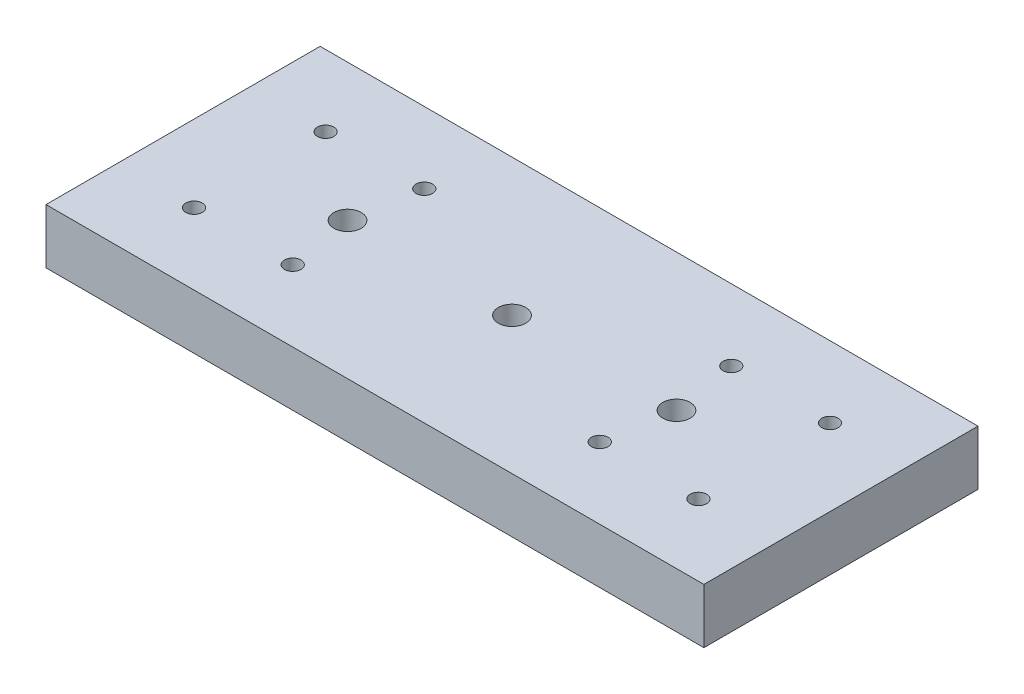
ISO-10303-21;
HEADER;
FILE_DESCRIPTION(('STEP AP214'),'2;1');
FILE_NAME('part.step','',(''),(''),'','','');
FILE_SCHEMA(('AUTOMOTIVE_DESIGN { 1 0 10303 214 1 1 1 1 }'));
ENDSEC;
DATA;
#1=APPLICATION_CONTEXT('core data for automotive mechanical design processes');
#2=APPLICATION_PROTOCOL_DEFINITION('international standard','automotive_design',2000,#1);
#3=PRODUCT_CONTEXT('',#1,'mechanical');
#4=PRODUCT('Part','Part','',(#3));
#5=PRODUCT_RELATED_PRODUCT_CATEGORY('part','',(#4));
#6=PRODUCT_DEFINITION_FORMATION('','',#4);
#7=PRODUCT_DEFINITION_CONTEXT('part definition',#1,'design');
#8=PRODUCT_DEFINITION('design','',#6,#7);
#9=PRODUCT_DEFINITION_SHAPE('','',#8);
#10=(LENGTH_UNIT() NAMED_UNIT(*) SI_UNIT(.MILLI.,.METRE.));
#11=(NAMED_UNIT(*) PLANE_ANGLE_UNIT() SI_UNIT($,.RADIAN.));
#12=(NAMED_UNIT(*) SI_UNIT($,.STERADIAN.) SOLID_ANGLE_UNIT());
#13=UNCERTAINTY_MEASURE_WITH_UNIT(LENGTH_MEASURE(1.E-05),#10,'distance_accuracy_value','');
#14=(GEOMETRIC_REPRESENTATION_CONTEXT(3) GLOBAL_UNCERTAINTY_ASSIGNED_CONTEXT((#13)) GLOBAL_UNIT_ASSIGNED_CONTEXT((#10,
#11,#12)) REPRESENTATION_CONTEXT('',''));
#15=CARTESIAN_POINT('',(0.,0.,0.));
#16=DIRECTION('',(0.,0.,1.));
#17=DIRECTION('',(1.,0.,0.));
#18=AXIS2_PLACEMENT_3D('',#15,#16,#17);
#19=CARTESIAN_POINT('',(0.,10.,0.));
#20=DIRECTION('',(0.,-1.,0.));
#21=DIRECTION('',(0.,0.,-1.));
#22=AXIS2_PLACEMENT_3D('',#19,#20,#21);
#23=CYLINDRICAL_SURFACE('',#22,2.5);
#24=CARTESIAN_POINT('',(0.,10.,0.));
#25=DIRECTION('',(0.,-1.,0.));
#26=DIRECTION('',(0.,0.,-1.));
#27=AXIS2_PLACEMENT_3D('',#24,#25,#26);
#28=CIRCLE('',#27,2.5);
#29=CARTESIAN_POINT('',(0.,10.,-2.5));
#30=VERTEX_POINT('',#29);
#31=EDGE_CURVE('E128',#30,#30,#28,.T.);
#32=ORIENTED_EDGE('',*,*,#31,.F.);
#33=EDGE_LOOP('',(#32));
#34=FACE_BOUND('',#33,.T.);
#35=CARTESIAN_POINT('',(0.,5.,0.));
#36=DIRECTION('',(0.,-1.,0.));
#37=DIRECTION('',(0.,0.,-1.));
#38=AXIS2_PLACEMENT_3D('',#35,#36,#37);
#39=CIRCLE('',#38,2.5);
#40=CARTESIAN_POINT('',(0.,5.,-2.5));
#41=VERTEX_POINT('',#40);
#42=EDGE_CURVE('E39',#41,#41,#39,.F.);
#43=ORIENTED_EDGE('',*,*,#42,.F.);
#44=EDGE_LOOP('',(#43));
#45=FACE_BOUND('',#44,.T.);
#46=ADVANCED_FACE('F35',(#34,#45),#23,.F.);
#47=CARTESIAN_POINT('',(29.9999999999984,10.,0.));
#48=DIRECTION('',(0.,-1.,0.));
#49=DIRECTION('',(0.,0.,-1.));
#50=AXIS2_PLACEMENT_3D('',#47,#48,#49);
#51=CYLINDRICAL_SURFACE('',#50,2.5);
#52=CARTESIAN_POINT('',(29.9999999999984,10.,0.));
#53=DIRECTION('',(0.,-1.,0.));
#54=DIRECTION('',(0.,0.,-1.));
#55=AXIS2_PLACEMENT_3D('',#52,#53,#54);
#56=CIRCLE('',#55,2.5);
#57=CARTESIAN_POINT('',(29.9999999999984,10.,-2.5));
#58=VERTEX_POINT('',#57);
#59=EDGE_CURVE('E123',#58,#58,#56,.T.);
#60=ORIENTED_EDGE('',*,*,#59,.F.);
#61=EDGE_LOOP('',(#60));
#62=FACE_BOUND('',#61,.T.);
#63=CARTESIAN_POINT('',(29.9999999999984,5.,0.));
#64=DIRECTION('',(0.,-1.,0.));
#65=DIRECTION('',(0.,0.,-1.));
#66=AXIS2_PLACEMENT_3D('',#63,#64,#65);
#67=CIRCLE('',#66,2.5);
#68=CARTESIAN_POINT('',(29.9999999999984,5.,-2.5));
#69=VERTEX_POINT('',#68);
#70=EDGE_CURVE('E113',#69,#69,#67,.F.);
#71=ORIENTED_EDGE('',*,*,#70,.F.);
#72=EDGE_LOOP('',(#71));
#73=FACE_BOUND('',#72,.T.);
#74=ADVANCED_FACE('F200',(#62,#73),#51,.F.);
#75=CARTESIAN_POINT('',(-30.,10.,0.));
#76=DIRECTION('',(0.,-1.,0.));
#77=DIRECTION('',(0.,0.,-1.));
#78=AXIS2_PLACEMENT_3D('',#75,#76,#77);
#79=CYLINDRICAL_SURFACE('',#78,2.5);
#80=CARTESIAN_POINT('',(-30.,10.,0.));
#81=DIRECTION('',(0.,-1.,0.));
#82=DIRECTION('',(0.,0.,-1.));
#83=AXIS2_PLACEMENT_3D('',#80,#81,#82);
#84=CIRCLE('',#83,2.5);
#85=CARTESIAN_POINT('',(-30.,10.,-2.5));
#86=VERTEX_POINT('',#85);
#87=EDGE_CURVE('E119',#86,#86,#84,.T.);
#88=ORIENTED_EDGE('',*,*,#87,.F.);
#89=EDGE_LOOP('',(#88));
#90=FACE_BOUND('',#89,.T.);
#91=CARTESIAN_POINT('',(-30.,5.,0.));
#92=DIRECTION('',(0.,-1.,0.));
#93=DIRECTION('',(0.,0.,-1.));
#94=AXIS2_PLACEMENT_3D('',#91,#92,#93);
#95=CIRCLE('',#94,2.5);
#96=CARTESIAN_POINT('',(-30.,5.,-2.5));
#97=VERTEX_POINT('',#96);
#98=EDGE_CURVE('E111',#97,#97,#95,.F.);
#99=ORIENTED_EDGE('',*,*,#98,.F.);
#100=EDGE_LOOP('',(#99));
#101=FACE_BOUND('',#100,.T.);
#102=ADVANCED_FACE('F206',(#90,#101),#79,.F.);
#103=CARTESIAN_POINT('',(-60.,10.,25.));
#104=DIRECTION('',(1.,0.,0.));
#105=DIRECTION('',(0.,0.,-1.));
#106=AXIS2_PLACEMENT_3D('',#103,#104,#105);
#107=PLANE('',#106);
#108=DIRECTION('',(0.,0.,1.));
#109=VECTOR('',#108,1.);
#110=CARTESIAN_POINT('',(-60.,0.,25.));
#111=LINE('',#110,#109);
#112=CARTESIAN_POINT('',(-60.,0.,-25.));
#113=VERTEX_POINT('',#112);
#114=CARTESIAN_POINT('',(-60.,0.,25.));
#115=VERTEX_POINT('',#114);
#116=EDGE_CURVE('E102',#113,#115,#111,.T.);
#117=ORIENTED_EDGE('',*,*,#116,.T.);
#118=DIRECTION('',(0.,-1.,0.));
#119=VECTOR('',#118,1.);
#120=CARTESIAN_POINT('',(-60.,10.,25.));
#121=LINE('',#120,#119);
#122=CARTESIAN_POINT('',(-60.,10.,25.));
#123=VERTEX_POINT('',#122);
#124=EDGE_CURVE('E11',#123,#115,#121,.T.);
#125=ORIENTED_EDGE('',*,*,#124,.F.);
#126=DIRECTION('',(0.,0.,1.));
#127=VECTOR('',#126,1.);
#128=CARTESIAN_POINT('',(-60.,10.,25.));
#129=LINE('',#128,#127);
#130=CARTESIAN_POINT('',(-60.,10.,-25.));
#131=VERTEX_POINT('',#130);
#132=EDGE_CURVE('E89',#131,#123,#129,.T.);
#133=ORIENTED_EDGE('',*,*,#132,.F.);
#134=DIRECTION('',(0.,-1.,0.));
#135=VECTOR('',#134,1.);
#136=CARTESIAN_POINT('',(-60.,10.,-25.));
#137=LINE('',#136,#135);
#138=EDGE_CURVE('E98',#131,#113,#137,.T.);
#139=ORIENTED_EDGE('',*,*,#138,.T.);
#140=EDGE_LOOP('',(#117,#125,#133,#139));
#141=FACE_BOUND('',#140,.T.);
#142=ADVANCED_FACE('F37',(#141),#107,.F.);
#143=CARTESIAN_POINT('',(60.,10.,25.));
#144=DIRECTION('',(0.,0.,-1.));
#145=DIRECTION('',(-1.,0.,0.));
#146=AXIS2_PLACEMENT_3D('',#143,#144,#145);
#147=PLANE('',#146);
#148=DIRECTION('',(1.,0.,0.));
#149=VECTOR('',#148,1.);
#150=CARTESIAN_POINT('',(60.,0.,25.));
#151=LINE('',#150,#149);
#152=CARTESIAN_POINT('',(60.,0.,25.));
#153=VERTEX_POINT('',#152);
#154=EDGE_CURVE('E93',#115,#153,#151,.T.);
#155=ORIENTED_EDGE('',*,*,#154,.T.);
#156=DIRECTION('',(0.,-1.,0.));
#157=VECTOR('',#156,1.);
#158=CARTESIAN_POINT('',(60.,10.,25.));
#159=LINE('',#158,#157);
#160=CARTESIAN_POINT('',(60.,10.,25.));
#161=VERTEX_POINT('',#160);
#162=EDGE_CURVE('E45',#161,#153,#159,.T.);
#163=ORIENTED_EDGE('',*,*,#162,.F.);
#164=DIRECTION('',(1.,0.,0.));
#165=VECTOR('',#164,1.);
#166=CARTESIAN_POINT('',(60.,10.,25.));
#167=LINE('',#166,#165);
#168=EDGE_CURVE('E84',#123,#161,#167,.T.);
#169=ORIENTED_EDGE('',*,*,#168,.F.);
#170=ORIENTED_EDGE('',*,*,#124,.T.);
#171=EDGE_LOOP('',(#155,#163,#169,#170));
#172=FACE_BOUND('',#171,.T.);
#173=ADVANCED_FACE('F92',(#172),#147,.F.);
#174=CARTESIAN_POINT('',(60.,10.,25.));
#175=DIRECTION('',(-1.,0.,0.));
#176=DIRECTION('',(0.,0.,1.));
#177=AXIS2_PLACEMENT_3D('',#174,#175,#176);
#178=PLANE('',#177);
#179=DIRECTION('',(0.,0.,-1.));
#180=VECTOR('',#179,1.);
#181=CARTESIAN_POINT('',(60.,0.,25.));
#182=LINE('',#181,#180);
#183=CARTESIAN_POINT('',(60.,0.,-25.));
#184=VERTEX_POINT('',#183);
#185=EDGE_CURVE('E71',#153,#184,#182,.T.);
#186=ORIENTED_EDGE('',*,*,#185,.T.);
#187=DIRECTION('',(0.,-1.,0.));
#188=VECTOR('',#187,1.);
#189=CARTESIAN_POINT('',(60.,10.,-25.));
#190=LINE('',#189,#188);
#191=CARTESIAN_POINT('',(60.,10.,-25.));
#192=VERTEX_POINT('',#191);
#193=EDGE_CURVE('E94',#192,#184,#190,.T.);
#194=ORIENTED_EDGE('',*,*,#193,.F.);
#195=DIRECTION('',(0.,0.,-1.));
#196=VECTOR('',#195,1.);
#197=CARTESIAN_POINT('',(60.,10.,25.));
#198=LINE('',#197,#196);
#199=EDGE_CURVE('E87',#161,#192,#198,.T.);
#200=ORIENTED_EDGE('',*,*,#199,.F.);
#201=ORIENTED_EDGE('',*,*,#162,.T.);
#202=EDGE_LOOP('',(#186,#194,#200,#201));
#203=FACE_BOUND('',#202,.T.);
#204=ADVANCED_FACE('F96',(#203),#178,.F.);
#205=CARTESIAN_POINT('',(60.,10.,-25.));
#206=DIRECTION('',(0.,0.,1.));
#207=DIRECTION('',(1.,0.,0.));
#208=AXIS2_PLACEMENT_3D('',#205,#206,#207);
#209=PLANE('',#208);
#210=DIRECTION('',(-1.,0.,0.));
#211=VECTOR('',#210,1.);
#212=CARTESIAN_POINT('',(60.,0.,-25.));
#213=LINE('',#212,#211);
#214=EDGE_CURVE('E77',#184,#113,#213,.T.);
#215=ORIENTED_EDGE('',*,*,#214,.T.);
#216=ORIENTED_EDGE('',*,*,#138,.F.);
#217=DIRECTION('',(-1.,0.,0.));
#218=VECTOR('',#217,1.);
#219=CARTESIAN_POINT('',(60.,10.,-25.));
#220=LINE('',#219,#218);
#221=EDGE_CURVE('E54',#192,#131,#220,.T.);
#222=ORIENTED_EDGE('',*,*,#221,.F.);
#223=ORIENTED_EDGE('',*,*,#193,.T.);
#224=EDGE_LOOP('',(#215,#216,#222,#223));
#225=FACE_BOUND('',#224,.T.);
#226=ADVANCED_FACE('F186',(#225),#209,.F.);
#227=CARTESIAN_POINT('',(0.,10.,0.));
#228=DIRECTION('',(0.,1.,0.));
#229=DIRECTION('',(0.,0.,1.));
#230=AXIS2_PLACEMENT_3D('',#227,#228,#229);
#231=PLANE('',#230);
#232=ORIENTED_EDGE('',*,*,#87,.T.);
#233=EDGE_LOOP('',(#232));
#234=FACE_BOUND('',#233,.T.);
#235=ORIENTED_EDGE('',*,*,#59,.T.);
#236=EDGE_LOOP('',(#235));
#237=FACE_BOUND('',#236,.T.);
#238=ORIENTED_EDGE('',*,*,#31,.T.);
#239=EDGE_LOOP('',(#238));
#240=FACE_BOUND('',#239,.T.);
#241=CARTESIAN_POINT('',(-45.9999999999993,10.,12.0000000000002));
#242=DIRECTION('',(0.,1.,0.));
#243=DIRECTION('',(0.,0.,1.));
#244=AXIS2_PLACEMENT_3D('',#241,#242,#243);
#245=CIRCLE('',#244,1.5);
#246=CARTESIAN_POINT('',(-45.9999999999993,10.,13.5000000000002));
#247=VERTEX_POINT('',#246);
#248=EDGE_CURVE('E144',#247,#247,#245,.T.);
#249=ORIENTED_EDGE('',*,*,#248,.F.);
#250=EDGE_LOOP('',(#249));
#251=FACE_BOUND('',#250,.T.);
#252=CARTESIAN_POINT('',(46.0000000000006,10.,-12.0000000000001));
#253=DIRECTION('',(0.,1.,0.));
#254=DIRECTION('',(0.,0.,1.));
#255=AXIS2_PLACEMENT_3D('',#252,#253,#254);
#256=CIRCLE('',#255,1.5);
#257=CARTESIAN_POINT('',(46.0000000000006,10.,-10.5000000000001));
#258=VERTEX_POINT('',#257);
#259=EDGE_CURVE('E157',#258,#258,#256,.T.);
#260=ORIENTED_EDGE('',*,*,#259,.F.);
#261=EDGE_LOOP('',(#260));
#262=FACE_BOUND('',#261,.T.);
#263=CARTESIAN_POINT('',(46.0000000000007,10.,11.9999999999999));
#264=DIRECTION('',(0.,1.,0.));
#265=DIRECTION('',(0.,0.,1.));
#266=AXIS2_PLACEMENT_3D('',#263,#264,#265);
#267=CIRCLE('',#266,1.5);
#268=CARTESIAN_POINT('',(46.0000000000007,10.,13.4999999999999));
#269=VERTEX_POINT('',#268);
#270=EDGE_CURVE('E156',#269,#269,#267,.T.);
#271=ORIENTED_EDGE('',*,*,#270,.F.);
#272=EDGE_LOOP('',(#271));
#273=FACE_BOUND('',#272,.T.);
#274=CARTESIAN_POINT('',(28.0000000000006,10.,-12.));
#275=DIRECTION('',(0.,1.,0.));
#276=DIRECTION('',(0.,0.,1.));
#277=AXIS2_PLACEMENT_3D('',#274,#275,#276);
#278=CIRCLE('',#277,1.5);
#279=CARTESIAN_POINT('',(28.0000000000006,10.,-10.5));
#280=VERTEX_POINT('',#279);
#281=EDGE_CURVE('E169',#280,#280,#278,.T.);
#282=ORIENTED_EDGE('',*,*,#281,.F.);
#283=EDGE_LOOP('',(#282));
#284=FACE_BOUND('',#283,.T.);
#285=CARTESIAN_POINT('',(-27.9999999999994,10.,-11.9999999999998));
#286=DIRECTION('',(0.,1.,0.));
#287=DIRECTION('',(0.,0.,1.));
#288=AXIS2_PLACEMENT_3D('',#285,#286,#287);
#289=CIRCLE('',#288,1.5);
#290=CARTESIAN_POINT('',(-27.9999999999994,10.,-10.4999999999998));
#291=VERTEX_POINT('',#290);
#292=EDGE_CURVE('E134',#291,#291,#289,.T.);
#293=ORIENTED_EDGE('',*,*,#292,.F.);
#294=EDGE_LOOP('',(#293));
#295=FACE_BOUND('',#294,.T.);
#296=CARTESIAN_POINT('',(-27.9999999999993,10.,12.0000000000002));
#297=DIRECTION('',(0.,1.,0.));
#298=DIRECTION('',(0.,0.,1.));
#299=AXIS2_PLACEMENT_3D('',#296,#297,#298);
#300=CIRCLE('',#299,1.5);
#301=CARTESIAN_POINT('',(-27.9999999999993,10.,13.5000000000002));
#302=VERTEX_POINT('',#301);
#303=EDGE_CURVE('E138',#302,#302,#300,.T.);
#304=ORIENTED_EDGE('',*,*,#303,.F.);
#305=EDGE_LOOP('',(#304));
#306=FACE_BOUND('',#305,.T.);
#307=CARTESIAN_POINT('',(-45.9999999999994,10.,-11.9999999999998));
#308=DIRECTION('',(0.,1.,0.));
#309=DIRECTION('',(0.,0.,1.));
#310=AXIS2_PLACEMENT_3D('',#307,#308,#309);
#311=CIRCLE('',#310,1.5);
#312=CARTESIAN_POINT('',(-45.9999999999994,10.,-10.4999999999998));
#313=VERTEX_POINT('',#312);
#314=EDGE_CURVE('E145',#313,#313,#311,.T.);
#315=ORIENTED_EDGE('',*,*,#314,.F.);
#316=EDGE_LOOP('',(#315));
#317=FACE_BOUND('',#316,.T.);
#318=CARTESIAN_POINT('',(28.0000000000007,10.,12.));
#319=DIRECTION('',(0.,1.,0.));
#320=DIRECTION('',(0.,0.,1.));
#321=AXIS2_PLACEMENT_3D('',#318,#319,#320);
#322=CIRCLE('',#321,1.5);
#323=CARTESIAN_POINT('',(28.0000000000007,10.,13.5));
#324=VERTEX_POINT('',#323);
#325=EDGE_CURVE('E168',#324,#324,#322,.T.);
#326=ORIENTED_EDGE('',*,*,#325,.F.);
#327=EDGE_LOOP('',(#326));
#328=FACE_BOUND('',#327,.T.);
#329=ORIENTED_EDGE('',*,*,#132,.T.);
#330=ORIENTED_EDGE('',*,*,#168,.T.);
#331=ORIENTED_EDGE('',*,*,#199,.T.);
#332=ORIENTED_EDGE('',*,*,#221,.T.);
#333=EDGE_LOOP('',(#329,#330,#331,#332));
#334=FACE_BOUND('',#333,.T.);
#335=ADVANCED_FACE('F85',(#234,#237,#240,#251,#262,#273,#284,#295,#306,#317,#328,#334),#231,.T.);
#336=CARTESIAN_POINT('',(0.,0.,0.));
#337=DIRECTION('',(0.,1.,0.));
#338=DIRECTION('',(0.,0.,1.));
#339=AXIS2_PLACEMENT_3D('',#336,#337,#338);
#340=PLANE('',#339);
#341=CARTESIAN_POINT('',(29.9999999999984,0.,0.));
#342=DIRECTION('',(0.,-1.,0.));
#343=DIRECTION('',(0.,0.,-1.));
#344=AXIS2_PLACEMENT_3D('',#341,#342,#343);
#345=CIRCLE('',#344,4.25);
#346=CARTESIAN_POINT('',(29.9999999999984,0.,-4.25));
#347=VERTEX_POINT('',#346);
#348=EDGE_CURVE('E291',#347,#347,#345,.T.);
#349=ORIENTED_EDGE('',*,*,#348,.F.);
#350=EDGE_LOOP('',(#349));
#351=FACE_BOUND('',#350,.T.);
#352=CARTESIAN_POINT('',(0.,0.,0.));
#353=DIRECTION('',(0.,-1.,0.));
#354=DIRECTION('',(0.,0.,-1.));
#355=AXIS2_PLACEMENT_3D('',#352,#353,#354);
#356=CIRCLE('',#355,4.25);
#357=CARTESIAN_POINT('',(0.,0.,-4.25));
#358=VERTEX_POINT('',#357);
#359=EDGE_CURVE('E299',#358,#358,#356,.T.);
#360=ORIENTED_EDGE('',*,*,#359,.F.);
#361=EDGE_LOOP('',(#360));
#362=FACE_BOUND('',#361,.T.);
#363=CARTESIAN_POINT('',(-30.,0.,0.));
#364=DIRECTION('',(0.,-1.,0.));
#365=DIRECTION('',(0.,0.,-1.));
#366=AXIS2_PLACEMENT_3D('',#363,#364,#365);
#367=CIRCLE('',#366,4.25);
#368=CARTESIAN_POINT('',(-30.,0.,-4.25));
#369=VERTEX_POINT('',#368);
#370=EDGE_CURVE('E303',#369,#369,#367,.T.);
#371=ORIENTED_EDGE('',*,*,#370,.F.);
#372=EDGE_LOOP('',(#371));
#373=FACE_BOUND('',#372,.T.);
#374=CARTESIAN_POINT('',(-45.9999999999993,0.,12.0000000000002));
#375=DIRECTION('',(0.,1.,0.));
#376=DIRECTION('',(0.,0.,1.));
#377=AXIS2_PLACEMENT_3D('',#374,#375,#376);
#378=CIRCLE('',#377,1.5);
#379=CARTESIAN_POINT('',(-45.9999999999993,0.,13.5000000000002));
#380=VERTEX_POINT('',#379);
#381=EDGE_CURVE('E160',#380,#380,#378,.T.);
#382=ORIENTED_EDGE('',*,*,#381,.T.);
#383=EDGE_LOOP('',(#382));
#384=FACE_BOUND('',#383,.T.);
#385=CARTESIAN_POINT('',(46.0000000000006,0.,-12.0000000000001));
#386=DIRECTION('',(0.,1.,0.));
#387=DIRECTION('',(0.,0.,1.));
#388=AXIS2_PLACEMENT_3D('',#385,#386,#387);
#389=CIRCLE('',#388,1.5);
#390=CARTESIAN_POINT('',(46.0000000000006,0.,-10.5000000000001));
#391=VERTEX_POINT('',#390);
#392=EDGE_CURVE('E153',#391,#391,#389,.T.);
#393=ORIENTED_EDGE('',*,*,#392,.T.);
#394=EDGE_LOOP('',(#393));
#395=FACE_BOUND('',#394,.T.);
#396=CARTESIAN_POINT('',(46.0000000000007,0.,11.9999999999999));
#397=DIRECTION('',(0.,1.,0.));
#398=DIRECTION('',(0.,0.,1.));
#399=AXIS2_PLACEMENT_3D('',#396,#397,#398);
#400=CIRCLE('',#399,1.5);
#401=CARTESIAN_POINT('',(46.0000000000007,0.,13.4999999999999));
#402=VERTEX_POINT('',#401);
#403=EDGE_CURVE('E172',#402,#402,#400,.T.);
#404=ORIENTED_EDGE('',*,*,#403,.T.);
#405=EDGE_LOOP('',(#404));
#406=FACE_BOUND('',#405,.T.);
#407=CARTESIAN_POINT('',(28.0000000000006,0.,-12.));
#408=DIRECTION('',(0.,1.,0.));
#409=DIRECTION('',(0.,0.,1.));
#410=AXIS2_PLACEMENT_3D('',#407,#408,#409);
#411=CIRCLE('',#410,1.5);
#412=CARTESIAN_POINT('',(28.0000000000006,0.,-10.5));
#413=VERTEX_POINT('',#412);
#414=EDGE_CURVE('E165',#413,#413,#411,.T.);
#415=ORIENTED_EDGE('',*,*,#414,.T.);
#416=EDGE_LOOP('',(#415));
#417=FACE_BOUND('',#416,.T.);
#418=CARTESIAN_POINT('',(-27.9999999999994,0.,-11.9999999999998));
#419=DIRECTION('',(0.,1.,0.));
#420=DIRECTION('',(0.,0.,1.));
#421=AXIS2_PLACEMENT_3D('',#418,#419,#420);
#422=CIRCLE('',#421,1.5);
#423=CARTESIAN_POINT('',(-27.9999999999994,0.,-10.4999999999998));
#424=VERTEX_POINT('',#423);
#425=EDGE_CURVE('E135',#424,#424,#422,.T.);
#426=ORIENTED_EDGE('',*,*,#425,.T.);
#427=EDGE_LOOP('',(#426));
#428=FACE_BOUND('',#427,.T.);
#429=CARTESIAN_POINT('',(-27.9999999999993,0.,12.0000000000002));
#430=DIRECTION('',(0.,1.,0.));
#431=DIRECTION('',(0.,0.,1.));
#432=AXIS2_PLACEMENT_3D('',#429,#430,#431);
#433=CIRCLE('',#432,1.5);
#434=CARTESIAN_POINT('',(-27.9999999999993,0.,13.5000000000002));
#435=VERTEX_POINT('',#434);
#436=EDGE_CURVE('E148',#435,#435,#433,.T.);
#437=ORIENTED_EDGE('',*,*,#436,.T.);
#438=EDGE_LOOP('',(#437));
#439=FACE_BOUND('',#438,.T.);
#440=CARTESIAN_POINT('',(-45.9999999999994,0.,-11.9999999999998));
#441=DIRECTION('',(0.,1.,0.));
#442=DIRECTION('',(0.,0.,1.));
#443=AXIS2_PLACEMENT_3D('',#440,#441,#442);
#444=CIRCLE('',#443,1.5);
#445=CARTESIAN_POINT('',(-45.9999999999994,0.,-10.4999999999998));
#446=VERTEX_POINT('',#445);
#447=EDGE_CURVE('E141',#446,#446,#444,.T.);
#448=ORIENTED_EDGE('',*,*,#447,.T.);
#449=EDGE_LOOP('',(#448));
#450=FACE_BOUND('',#449,.T.);
#451=CARTESIAN_POINT('',(28.0000000000007,0.,12.));
#452=DIRECTION('',(0.,1.,0.));
#453=DIRECTION('',(0.,0.,1.));
#454=AXIS2_PLACEMENT_3D('',#451,#452,#453);
#455=CIRCLE('',#454,1.5);
#456=CARTESIAN_POINT('',(28.0000000000007,0.,13.5));
#457=VERTEX_POINT('',#456);
#458=EDGE_CURVE('E105',#457,#457,#455,.T.);
#459=ORIENTED_EDGE('',*,*,#458,.T.);
#460=EDGE_LOOP('',(#459));
#461=FACE_BOUND('',#460,.T.);
#462=ORIENTED_EDGE('',*,*,#116,.F.);
#463=ORIENTED_EDGE('',*,*,#214,.F.);
#464=ORIENTED_EDGE('',*,*,#185,.F.);
#465=ORIENTED_EDGE('',*,*,#154,.F.);
#466=EDGE_LOOP('',(#462,#463,#464,#465));
#467=FACE_BOUND('',#466,.T.);
#468=ADVANCED_FACE('F185',(#351,#362,#373,#384,#395,#406,#417,#428,#439,#450,#461,#467),#340,.F.);
#469=CARTESIAN_POINT('',(28.0000000000007,0.,12.));
#470=DIRECTION('',(0.,1.,0.));
#471=DIRECTION('',(0.,0.,1.));
#472=AXIS2_PLACEMENT_3D('',#469,#470,#471);
#473=CYLINDRICAL_SURFACE('',#472,1.5);
#474=ORIENTED_EDGE('',*,*,#458,.F.);
#475=EDGE_LOOP('',(#474));
#476=FACE_BOUND('',#475,.T.);
#477=ORIENTED_EDGE('',*,*,#325,.T.);
#478=EDGE_LOOP('',(#477));
#479=FACE_BOUND('',#478,.T.);
#480=ADVANCED_FACE('F182',(#476,#479),#473,.F.);
#481=CARTESIAN_POINT('',(-45.9999999999994,0.,-11.9999999999998));
#482=DIRECTION('',(0.,1.,0.));
#483=DIRECTION('',(0.,0.,1.));
#484=AXIS2_PLACEMENT_3D('',#481,#482,#483);
#485=CYLINDRICAL_SURFACE('',#484,1.5);
#486=ORIENTED_EDGE('',*,*,#447,.F.);
#487=EDGE_LOOP('',(#486));
#488=FACE_BOUND('',#487,.T.);
#489=ORIENTED_EDGE('',*,*,#314,.T.);
#490=EDGE_LOOP('',(#489));
#491=FACE_BOUND('',#490,.T.);
#492=ADVANCED_FACE('F219',(#488,#491),#485,.F.);
#493=CARTESIAN_POINT('',(-27.9999999999993,0.,12.0000000000002));
#494=DIRECTION('',(0.,1.,0.));
#495=DIRECTION('',(0.,0.,1.));
#496=AXIS2_PLACEMENT_3D('',#493,#494,#495);
#497=CYLINDRICAL_SURFACE('',#496,1.5);
#498=ORIENTED_EDGE('',*,*,#436,.F.);
#499=EDGE_LOOP('',(#498));
#500=FACE_BOUND('',#499,.T.);
#501=ORIENTED_EDGE('',*,*,#303,.T.);
#502=EDGE_LOOP('',(#501));
#503=FACE_BOUND('',#502,.T.);
#504=ADVANCED_FACE('F217',(#500,#503),#497,.F.);
#505=CARTESIAN_POINT('',(-27.9999999999994,0.,-11.9999999999998));
#506=DIRECTION('',(0.,1.,0.));
#507=DIRECTION('',(0.,0.,1.));
#508=AXIS2_PLACEMENT_3D('',#505,#506,#507);
#509=CYLINDRICAL_SURFACE('',#508,1.5);
#510=ORIENTED_EDGE('',*,*,#425,.F.);
#511=EDGE_LOOP('',(#510));
#512=FACE_BOUND('',#511,.T.);
#513=ORIENTED_EDGE('',*,*,#292,.T.);
#514=EDGE_LOOP('',(#513));
#515=FACE_BOUND('',#514,.T.);
#516=ADVANCED_FACE('F213',(#512,#515),#509,.F.);
#517=CARTESIAN_POINT('',(28.0000000000006,0.,-12.));
#518=DIRECTION('',(0.,1.,0.));
#519=DIRECTION('',(0.,0.,1.));
#520=AXIS2_PLACEMENT_3D('',#517,#518,#519);
#521=CYLINDRICAL_SURFACE('',#520,1.5);
#522=ORIENTED_EDGE('',*,*,#414,.F.);
#523=EDGE_LOOP('',(#522));
#524=FACE_BOUND('',#523,.T.);
#525=ORIENTED_EDGE('',*,*,#281,.T.);
#526=EDGE_LOOP('',(#525));
#527=FACE_BOUND('',#526,.T.);
#528=ADVANCED_FACE('F216',(#524,#527),#521,.F.);
#529=CARTESIAN_POINT('',(46.0000000000007,0.,11.9999999999999));
#530=DIRECTION('',(0.,1.,0.));
#531=DIRECTION('',(0.,0.,1.));
#532=AXIS2_PLACEMENT_3D('',#529,#530,#531);
#533=CYLINDRICAL_SURFACE('',#532,1.5);
#534=ORIENTED_EDGE('',*,*,#403,.F.);
#535=EDGE_LOOP('',(#534));
#536=FACE_BOUND('',#535,.T.);
#537=ORIENTED_EDGE('',*,*,#270,.T.);
#538=EDGE_LOOP('',(#537));
#539=FACE_BOUND('',#538,.T.);
#540=ADVANCED_FACE('F230',(#536,#539),#533,.F.);
#541=CARTESIAN_POINT('',(46.0000000000006,0.,-12.0000000000001));
#542=DIRECTION('',(0.,1.,0.));
#543=DIRECTION('',(0.,0.,1.));
#544=AXIS2_PLACEMENT_3D('',#541,#542,#543);
#545=CYLINDRICAL_SURFACE('',#544,1.5);
#546=ORIENTED_EDGE('',*,*,#392,.F.);
#547=EDGE_LOOP('',(#546));
#548=FACE_BOUND('',#547,.T.);
#549=ORIENTED_EDGE('',*,*,#259,.T.);
#550=EDGE_LOOP('',(#549));
#551=FACE_BOUND('',#550,.T.);
#552=ADVANCED_FACE('F226',(#548,#551),#545,.F.);
#553=CARTESIAN_POINT('',(-45.9999999999993,0.,12.0000000000002));
#554=DIRECTION('',(0.,1.,0.));
#555=DIRECTION('',(0.,0.,1.));
#556=AXIS2_PLACEMENT_3D('',#553,#554,#555);
#557=CYLINDRICAL_SURFACE('',#556,1.5);
#558=ORIENTED_EDGE('',*,*,#381,.F.);
#559=EDGE_LOOP('',(#558));
#560=FACE_BOUND('',#559,.T.);
#561=ORIENTED_EDGE('',*,*,#248,.T.);
#562=EDGE_LOOP('',(#561));
#563=FACE_BOUND('',#562,.T.);
#564=ADVANCED_FACE('F229',(#560,#563),#557,.F.);
#565=CARTESIAN_POINT('',(-30.,5.,0.));
#566=DIRECTION('',(0.,-1.,0.));
#567=DIRECTION('',(0.,0.,-1.));
#568=AXIS2_PLACEMENT_3D('',#565,#566,#567);
#569=PLANE('',#568);
#570=CARTESIAN_POINT('',(-30.,5.,0.));
#571=DIRECTION('',(0.,-1.,0.));
#572=DIRECTION('',(0.,0.,-1.));
#573=AXIS2_PLACEMENT_3D('',#570,#571,#572);
#574=CIRCLE('',#573,4.25);
#575=CARTESIAN_POINT('',(-30.,5.,-4.25));
#576=VERTEX_POINT('',#575);
#577=EDGE_CURVE('E302',#576,#576,#574,.T.);
#578=ORIENTED_EDGE('',*,*,#577,.T.);
#579=EDGE_LOOP('',(#578));
#580=FACE_BOUND('',#579,.T.);
#581=ORIENTED_EDGE('',*,*,#98,.T.);
#582=EDGE_LOOP('',(#581));
#583=FACE_BOUND('',#582,.T.);
#584=ADVANCED_FACE('F234',(#580,#583),#569,.T.);
#585=CARTESIAN_POINT('',(-30.,5.,0.));
#586=DIRECTION('',(0.,-1.,0.));
#587=DIRECTION('',(0.,0.,-1.));
#588=AXIS2_PLACEMENT_3D('',#585,#586,#587);
#589=CYLINDRICAL_SURFACE('',#588,4.25);
#590=ORIENTED_EDGE('',*,*,#577,.F.);
#591=EDGE_LOOP('',(#590));
#592=FACE_BOUND('',#591,.T.);
#593=ORIENTED_EDGE('',*,*,#370,.T.);
#594=EDGE_LOOP('',(#593));
#595=FACE_BOUND('',#594,.T.);
#596=ADVANCED_FACE('F262',(#592,#595),#589,.F.);
#597=CARTESIAN_POINT('',(29.9999999999984,5.,0.));
#598=DIRECTION('',(0.,-1.,0.));
#599=DIRECTION('',(0.,0.,-1.));
#600=AXIS2_PLACEMENT_3D('',#597,#598,#599);
#601=PLANE('',#600);
#602=CARTESIAN_POINT('',(29.9999999999984,5.,0.));
#603=DIRECTION('',(0.,-1.,0.));
#604=DIRECTION('',(0.,0.,-1.));
#605=AXIS2_PLACEMENT_3D('',#602,#603,#604);
#606=CIRCLE('',#605,4.25);
#607=CARTESIAN_POINT('',(29.9999999999984,5.,-4.25));
#608=VERTEX_POINT('',#607);
#609=EDGE_CURVE('E114',#608,#608,#606,.T.);
#610=ORIENTED_EDGE('',*,*,#609,.T.);
#611=EDGE_LOOP('',(#610));
#612=FACE_BOUND('',#611,.T.);
#613=ORIENTED_EDGE('',*,*,#70,.T.);
#614=EDGE_LOOP('',(#613));
#615=FACE_BOUND('',#614,.T.);
#616=ADVANCED_FACE('F268',(#612,#615),#601,.T.);
#617=CARTESIAN_POINT('',(29.9999999999984,5.,0.));
#618=DIRECTION('',(0.,-1.,0.));
#619=DIRECTION('',(0.,0.,-1.));
#620=AXIS2_PLACEMENT_3D('',#617,#618,#619);
#621=CYLINDRICAL_SURFACE('',#620,4.25);
#622=ORIENTED_EDGE('',*,*,#609,.F.);
#623=EDGE_LOOP('',(#622));
#624=FACE_BOUND('',#623,.T.);
#625=ORIENTED_EDGE('',*,*,#348,.T.);
#626=EDGE_LOOP('',(#625));
#627=FACE_BOUND('',#626,.T.);
#628=ADVANCED_FACE('F280',(#624,#627),#621,.F.);
#629=CARTESIAN_POINT('',(0.,5.,0.));
#630=DIRECTION('',(0.,-1.,0.));
#631=DIRECTION('',(0.,0.,-1.));
#632=AXIS2_PLACEMENT_3D('',#629,#630,#631);
#633=PLANE('',#632);
#634=CARTESIAN_POINT('',(0.,5.,0.));
#635=DIRECTION('',(0.,-1.,0.));
#636=DIRECTION('',(0.,0.,-1.));
#637=AXIS2_PLACEMENT_3D('',#634,#635,#636);
#638=CIRCLE('',#637,4.25);
#639=CARTESIAN_POINT('',(0.,5.,-4.25));
#640=VERTEX_POINT('',#639);
#641=EDGE_CURVE('E294',#640,#640,#638,.T.);
#642=ORIENTED_EDGE('',*,*,#641,.T.);
#643=EDGE_LOOP('',(#642));
#644=FACE_BOUND('',#643,.T.);
#645=ORIENTED_EDGE('',*,*,#42,.T.);
#646=EDGE_LOOP('',(#645));
#647=FACE_BOUND('',#646,.T.);
#648=ADVANCED_FACE('F276',(#644,#647),#633,.T.);
#649=CARTESIAN_POINT('',(0.,5.,0.));
#650=DIRECTION('',(0.,-1.,0.));
#651=DIRECTION('',(0.,0.,-1.));
#652=AXIS2_PLACEMENT_3D('',#649,#650,#651);
#653=CYLINDRICAL_SURFACE('',#652,4.25);
#654=ORIENTED_EDGE('',*,*,#641,.F.);
#655=EDGE_LOOP('',(#654));
#656=FACE_BOUND('',#655,.T.);
#657=ORIENTED_EDGE('',*,*,#359,.T.);
#658=EDGE_LOOP('',(#657));
#659=FACE_BOUND('',#658,.T.);
#660=ADVANCED_FACE('F273',(#656,#659),#653,.F.);
#661=CLOSED_SHELL('',(#46,#74,#102,#142,#173,#204,#226,#335,#468,#480,#492,#504,#516,#528,#540,
#552,#564,#584,#596,#616,#628,#648,#660));
#662=MANIFOLD_SOLID_BREP('B2',#661);
#663=ADVANCED_BREP_SHAPE_REPRESENTATION('',(#18,#662),#14);
#664=SHAPE_DEFINITION_REPRESENTATION(#9,#663);
ENDSEC;
END-ISO-10303-21;
